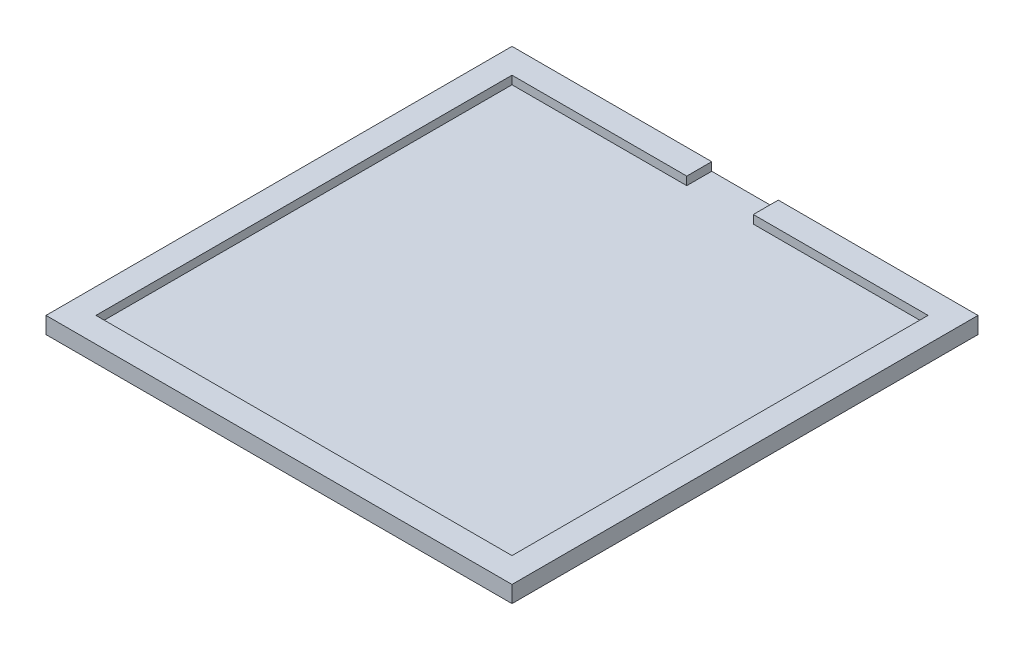
ISO-10303-21;
HEADER;
FILE_DESCRIPTION(('STEP AP214'),'2;1');
FILE_NAME('part.step','',(''),(''),'','','');
FILE_SCHEMA(('AUTOMOTIVE_DESIGN { 1 0 10303 214 1 1 1 1 }'));
ENDSEC;
DATA;
#1=APPLICATION_CONTEXT('core data for automotive mechanical design processes');
#2=APPLICATION_PROTOCOL_DEFINITION('international standard','automotive_design',2000,#1);
#3=PRODUCT_CONTEXT('',#1,'mechanical');
#4=PRODUCT('Part','Part','',(#3));
#5=PRODUCT_RELATED_PRODUCT_CATEGORY('part','',(#4));
#6=PRODUCT_DEFINITION_FORMATION('','',#4);
#7=PRODUCT_DEFINITION_CONTEXT('part definition',#1,'design');
#8=PRODUCT_DEFINITION('design','',#6,#7);
#9=PRODUCT_DEFINITION_SHAPE('','',#8);
#10=(LENGTH_UNIT() NAMED_UNIT(*) SI_UNIT(.MILLI.,.METRE.));
#11=(NAMED_UNIT(*) PLANE_ANGLE_UNIT() SI_UNIT($,.RADIAN.));
#12=(NAMED_UNIT(*) SI_UNIT($,.STERADIAN.) SOLID_ANGLE_UNIT());
#13=UNCERTAINTY_MEASURE_WITH_UNIT(LENGTH_MEASURE(1.E-05),#10,'distance_accuracy_value','');
#14=(GEOMETRIC_REPRESENTATION_CONTEXT(3) GLOBAL_UNCERTAINTY_ASSIGNED_CONTEXT((#13)) GLOBAL_UNIT_ASSIGNED_CONTEXT((#10,
#11,#12)) REPRESENTATION_CONTEXT('',''));
#15=CARTESIAN_POINT('',(0.,0.,0.));
#16=DIRECTION('',(0.,0.,1.));
#17=DIRECTION('',(1.,0.,0.));
#18=AXIS2_PLACEMENT_3D('',#15,#16,#17);
#19=CARTESIAN_POINT('',(0.,2.,-25.));
#20=DIRECTION('',(0.,0.,-1.));
#21=DIRECTION('',(-1.,0.,0.));
#22=AXIS2_PLACEMENT_3D('',#19,#20,#21);
#23=PLANE('',#22);
#24=DIRECTION('',(-1.,0.,0.));
#25=VECTOR('',#24,1.);
#26=CARTESIAN_POINT('',(0.,1.,-25.));
#27=LINE('',#26,#25);
#28=CARTESIAN_POINT('',(-4.,1.,-25.));
#29=VERTEX_POINT('',#28);
#30=CARTESIAN_POINT('',(-25.,1.,-25.));
#31=VERTEX_POINT('',#30);
#32=EDGE_CURVE('E190',#29,#31,#27,.T.);
#33=ORIENTED_EDGE('',*,*,#32,.F.);
#34=DIRECTION('',(0.,1.,0.));
#35=VECTOR('',#34,1.);
#36=CARTESIAN_POINT('',(-4.,2.,-25.));
#37=LINE('',#36,#35);
#38=CARTESIAN_POINT('',(-4.,2.,-25.));
#39=VERTEX_POINT('',#38);
#40=EDGE_CURVE('E138',#29,#39,#37,.T.);
#41=ORIENTED_EDGE('',*,*,#40,.T.);
#42=DIRECTION('',(1.,0.,0.));
#43=VECTOR('',#42,1.);
#44=CARTESIAN_POINT('',(0.,2.,-25.));
#45=LINE('',#44,#43);
#46=CARTESIAN_POINT('',(-25.,2.,-25.));
#47=VERTEX_POINT('',#46);
#48=EDGE_CURVE('E160',#47,#39,#45,.T.);
#49=ORIENTED_EDGE('',*,*,#48,.F.);
#50=DIRECTION('',(0.,-1.,0.));
#51=VECTOR('',#50,1.);
#52=CARTESIAN_POINT('',(-25.,2.,-25.));
#53=LINE('',#52,#51);
#54=EDGE_CURVE('E171',#47,#31,#53,.T.);
#55=ORIENTED_EDGE('',*,*,#54,.T.);
#56=EDGE_LOOP('',(#33,#41,#49,#55));
#57=FACE_BOUND('',#56,.T.);
#58=ADVANCED_FACE('F35',(#57),#23,.F.);
#59=CARTESIAN_POINT('',(0.,1.,-28.));
#60=DIRECTION('',(0.,0.,-1.));
#61=DIRECTION('',(-1.,0.,0.));
#62=AXIS2_PLACEMENT_3D('',#59,#60,#61);
#63=PLANE('',#62);
#64=DIRECTION('',(0.,1.,0.));
#65=VECTOR('',#64,1.);
#66=CARTESIAN_POINT('',(-4.,1.,-28.));
#67=LINE('',#66,#65);
#68=CARTESIAN_POINT('',(-4.,1.,-28.));
#69=VERTEX_POINT('',#68);
#70=CARTESIAN_POINT('',(-4.,2.,-28.));
#71=VERTEX_POINT('',#70);
#72=EDGE_CURVE('E150',#69,#71,#67,.T.);
#73=ORIENTED_EDGE('',*,*,#72,.F.);
#74=DIRECTION('',(-1.,0.,0.));
#75=VECTOR('',#74,1.);
#76=CARTESIAN_POINT('',(0.,1.,-28.));
#77=LINE('',#76,#75);
#78=CARTESIAN_POINT('',(4.,1.,-28.));
#79=VERTEX_POINT('',#78);
#80=EDGE_CURVE('E137',#79,#69,#77,.T.);
#81=ORIENTED_EDGE('',*,*,#80,.F.);
#82=DIRECTION('',(0.,-1.,0.));
#83=VECTOR('',#82,1.);
#84=CARTESIAN_POINT('',(4.,1.,-28.));
#85=LINE('',#84,#83);
#86=CARTESIAN_POINT('',(4.,2.,-28.));
#87=VERTEX_POINT('',#86);
#88=EDGE_CURVE('E124',#87,#79,#85,.T.);
#89=ORIENTED_EDGE('',*,*,#88,.F.);
#90=DIRECTION('',(1.,0.,0.));
#91=VECTOR('',#90,1.);
#92=CARTESIAN_POINT('',(0.,2.,-28.));
#93=LINE('',#92,#91);
#94=CARTESIAN_POINT('',(28.,2.,-28.));
#95=VERTEX_POINT('',#94);
#96=EDGE_CURVE('E135',#87,#95,#93,.T.);
#97=ORIENTED_EDGE('',*,*,#96,.T.);
#98=DIRECTION('',(0.,-1.,0.));
#99=VECTOR('',#98,1.);
#100=CARTESIAN_POINT('',(28.,1.,-28.));
#101=LINE('',#100,#99);
#102=CARTESIAN_POINT('',(28.,0.,-28.));
#103=VERTEX_POINT('',#102);
#104=EDGE_CURVE('E204',#95,#103,#101,.T.);
#105=ORIENTED_EDGE('',*,*,#104,.T.);
#106=DIRECTION('',(1.,0.,0.));
#107=VECTOR('',#106,1.);
#108=CARTESIAN_POINT('',(0.,0.,-28.));
#109=LINE('',#108,#107);
#110=CARTESIAN_POINT('',(-28.,0.,-28.));
#111=VERTEX_POINT('',#110);
#112=EDGE_CURVE('E193',#111,#103,#109,.T.);
#113=ORIENTED_EDGE('',*,*,#112,.F.);
#114=DIRECTION('',(0.,-1.,0.));
#115=VECTOR('',#114,1.);
#116=CARTESIAN_POINT('',(-28.,1.,-28.));
#117=LINE('',#116,#115);
#118=CARTESIAN_POINT('',(-28.,2.,-28.));
#119=VERTEX_POINT('',#118);
#120=EDGE_CURVE('E11',#119,#111,#117,.T.);
#121=ORIENTED_EDGE('',*,*,#120,.F.);
#122=EDGE_CURVE('E146',#119,#71,#93,.T.);
#123=ORIENTED_EDGE('',*,*,#122,.T.);
#124=EDGE_LOOP('',(#73,#81,#89,#97,#105,#113,#121,#123));
#125=FACE_BOUND('',#124,.T.);
#126=ADVANCED_FACE('F37',(#125),#63,.T.);
#127=CARTESIAN_POINT('',(-28.,1.,0.));
#128=DIRECTION('',(1.,0.,0.));
#129=DIRECTION('',(0.,0.,-1.));
#130=AXIS2_PLACEMENT_3D('',#127,#128,#129);
#131=PLANE('',#130);
#132=DIRECTION('',(0.,0.,1.));
#133=VECTOR('',#132,1.);
#134=CARTESIAN_POINT('',(-28.,0.,0.));
#135=LINE('',#134,#133);
#136=CARTESIAN_POINT('',(-28.,0.,28.));
#137=VERTEX_POINT('',#136);
#138=EDGE_CURVE('E196',#111,#137,#135,.T.);
#139=ORIENTED_EDGE('',*,*,#138,.T.);
#140=DIRECTION('',(0.,-1.,0.));
#141=VECTOR('',#140,1.);
#142=CARTESIAN_POINT('',(-28.,1.,28.));
#143=LINE('',#142,#141);
#144=CARTESIAN_POINT('',(-28.,2.,28.));
#145=VERTEX_POINT('',#144);
#146=EDGE_CURVE('E43',#145,#137,#143,.T.);
#147=ORIENTED_EDGE('',*,*,#146,.F.);
#148=DIRECTION('',(0.,0.,1.));
#149=VECTOR('',#148,1.);
#150=CARTESIAN_POINT('',(-28.,2.,0.));
#151=LINE('',#150,#149);
#152=EDGE_CURVE('E149',#119,#145,#151,.T.);
#153=ORIENTED_EDGE('',*,*,#152,.F.);
#154=ORIENTED_EDGE('',*,*,#120,.T.);
#155=EDGE_LOOP('',(#139,#147,#153,#154));
#156=FACE_BOUND('',#155,.T.);
#157=ADVANCED_FACE('F222',(#156),#131,.F.);
#158=CARTESIAN_POINT('',(0.,1.,28.));
#159=DIRECTION('',(0.,0.,-1.));
#160=DIRECTION('',(-1.,0.,0.));
#161=AXIS2_PLACEMENT_3D('',#158,#159,#160);
#162=PLANE('',#161);
#163=DIRECTION('',(1.,0.,0.));
#164=VECTOR('',#163,1.);
#165=CARTESIAN_POINT('',(0.,0.,28.));
#166=LINE('',#165,#164);
#167=CARTESIAN_POINT('',(28.,0.,28.));
#168=VERTEX_POINT('',#167);
#169=EDGE_CURVE('E198',#137,#168,#166,.T.);
#170=ORIENTED_EDGE('',*,*,#169,.T.);
#171=DIRECTION('',(0.,-1.,0.));
#172=VECTOR('',#171,1.);
#173=CARTESIAN_POINT('',(28.,1.,28.));
#174=LINE('',#173,#172);
#175=CARTESIAN_POINT('',(28.,2.,28.));
#176=VERTEX_POINT('',#175);
#177=EDGE_CURVE('E206',#176,#168,#174,.T.);
#178=ORIENTED_EDGE('',*,*,#177,.F.);
#179=DIRECTION('',(1.,0.,0.));
#180=VECTOR('',#179,1.);
#181=CARTESIAN_POINT('',(0.,2.,28.));
#182=LINE('',#181,#180);
#183=EDGE_CURVE('E156',#145,#176,#182,.T.);
#184=ORIENTED_EDGE('',*,*,#183,.F.);
#185=ORIENTED_EDGE('',*,*,#146,.T.);
#186=EDGE_LOOP('',(#170,#178,#184,#185));
#187=FACE_BOUND('',#186,.T.);
#188=ADVANCED_FACE('F211',(#187),#162,.F.);
#189=CARTESIAN_POINT('',(28.,1.,0.));
#190=DIRECTION('',(1.,0.,0.));
#191=DIRECTION('',(0.,0.,-1.));
#192=AXIS2_PLACEMENT_3D('',#189,#190,#191);
#193=PLANE('',#192);
#194=DIRECTION('',(0.,0.,1.));
#195=VECTOR('',#194,1.);
#196=CARTESIAN_POINT('',(28.,0.,0.));
#197=LINE('',#196,#195);
#198=EDGE_CURVE('E201',#103,#168,#197,.T.);
#199=ORIENTED_EDGE('',*,*,#198,.F.);
#200=ORIENTED_EDGE('',*,*,#104,.F.);
#201=DIRECTION('',(0.,0.,1.));
#202=VECTOR('',#201,1.);
#203=CARTESIAN_POINT('',(28.,2.,0.));
#204=LINE('',#203,#202);
#205=EDGE_CURVE('E145',#95,#176,#204,.T.);
#206=ORIENTED_EDGE('',*,*,#205,.T.);
#207=ORIENTED_EDGE('',*,*,#177,.T.);
#208=EDGE_LOOP('',(#199,#200,#206,#207));
#209=FACE_BOUND('',#208,.T.);
#210=ADVANCED_FACE('F220',(#209),#193,.T.);
#211=CARTESIAN_POINT('',(0.,0.,0.));
#212=DIRECTION('',(0.,1.,0.));
#213=DIRECTION('',(0.,0.,1.));
#214=AXIS2_PLACEMENT_3D('',#211,#212,#213);
#215=PLANE('',#214);
#216=ORIENTED_EDGE('',*,*,#112,.T.);
#217=ORIENTED_EDGE('',*,*,#198,.T.);
#218=ORIENTED_EDGE('',*,*,#169,.F.);
#219=ORIENTED_EDGE('',*,*,#138,.F.);
#220=EDGE_LOOP('',(#216,#217,#218,#219));
#221=FACE_BOUND('',#220,.T.);
#222=ADVANCED_FACE('F216',(#221),#215,.F.);
#223=CARTESIAN_POINT('',(4.,2.,-25.));
#224=VERTEX_POINT('',#223);
#225=CARTESIAN_POINT('',(25.,2.,-25.));
#226=VERTEX_POINT('',#225);
#227=EDGE_CURVE('E159',#224,#226,#45,.T.);
#228=ORIENTED_EDGE('',*,*,#227,.F.);
#229=DIRECTION('',(0.,-1.,0.));
#230=VECTOR('',#229,1.);
#231=CARTESIAN_POINT('',(4.,2.,-25.));
#232=LINE('',#231,#230);
#233=CARTESIAN_POINT('',(4.,1.,-25.));
#234=VERTEX_POINT('',#233);
#235=EDGE_CURVE('E50',#224,#234,#232,.T.);
#236=ORIENTED_EDGE('',*,*,#235,.T.);
#237=CARTESIAN_POINT('',(25.,1.,-25.));
#238=VERTEX_POINT('',#237);
#239=EDGE_CURVE('E191',#238,#234,#27,.T.);
#240=ORIENTED_EDGE('',*,*,#239,.F.);
#241=DIRECTION('',(0.,-1.,0.));
#242=VECTOR('',#241,1.);
#243=CARTESIAN_POINT('',(25.,2.,-25.));
#244=LINE('',#243,#242);
#245=EDGE_CURVE('E180',#226,#238,#244,.T.);
#246=ORIENTED_EDGE('',*,*,#245,.F.);
#247=EDGE_LOOP('',(#228,#236,#240,#246));
#248=FACE_BOUND('',#247,.T.);
#249=ADVANCED_FACE('F249',(#248),#23,.F.);
#250=CARTESIAN_POINT('',(25.,2.,0.));
#251=DIRECTION('',(1.,0.,0.));
#252=DIRECTION('',(0.,0.,-1.));
#253=AXIS2_PLACEMENT_3D('',#250,#251,#252);
#254=PLANE('',#253);
#255=DIRECTION('',(0.,0.,-1.));
#256=VECTOR('',#255,1.);
#257=CARTESIAN_POINT('',(25.,1.,0.));
#258=LINE('',#257,#256);
#259=CARTESIAN_POINT('',(25.,1.,25.));
#260=VERTEX_POINT('',#259);
#261=EDGE_CURVE('E58',#260,#238,#258,.T.);
#262=ORIENTED_EDGE('',*,*,#261,.F.);
#263=DIRECTION('',(0.,-1.,0.));
#264=VECTOR('',#263,1.);
#265=CARTESIAN_POINT('',(25.,2.,25.));
#266=LINE('',#265,#264);
#267=CARTESIAN_POINT('',(25.,2.,25.));
#268=VERTEX_POINT('',#267);
#269=EDGE_CURVE('E177',#268,#260,#266,.T.);
#270=ORIENTED_EDGE('',*,*,#269,.F.);
#271=DIRECTION('',(0.,0.,1.));
#272=VECTOR('',#271,1.);
#273=CARTESIAN_POINT('',(25.,2.,0.));
#274=LINE('',#273,#272);
#275=EDGE_CURVE('E163',#226,#268,#274,.T.);
#276=ORIENTED_EDGE('',*,*,#275,.F.);
#277=ORIENTED_EDGE('',*,*,#245,.T.);
#278=EDGE_LOOP('',(#262,#270,#276,#277));
#279=FACE_BOUND('',#278,.T.);
#280=ADVANCED_FACE('F246',(#279),#254,.F.);
#281=CARTESIAN_POINT('',(0.,2.,25.));
#282=DIRECTION('',(0.,0.,-1.));
#283=DIRECTION('',(-1.,0.,0.));
#284=AXIS2_PLACEMENT_3D('',#281,#282,#283);
#285=PLANE('',#284);
#286=ORIENTED_EDGE('',*,*,#269,.T.);
#287=DIRECTION('',(-1.,0.,0.));
#288=VECTOR('',#287,1.);
#289=CARTESIAN_POINT('',(0.,1.,25.));
#290=LINE('',#289,#288);
#291=CARTESIAN_POINT('',(-25.,1.,25.));
#292=VERTEX_POINT('',#291);
#293=EDGE_CURVE('E186',#260,#292,#290,.T.);
#294=ORIENTED_EDGE('',*,*,#293,.T.);
#295=DIRECTION('',(0.,-1.,0.));
#296=VECTOR('',#295,1.);
#297=CARTESIAN_POINT('',(-25.,2.,25.));
#298=LINE('',#297,#296);
#299=CARTESIAN_POINT('',(-25.,2.,25.));
#300=VERTEX_POINT('',#299);
#301=EDGE_CURVE('E174',#300,#292,#298,.T.);
#302=ORIENTED_EDGE('',*,*,#301,.F.);
#303=DIRECTION('',(1.,0.,0.));
#304=VECTOR('',#303,1.);
#305=CARTESIAN_POINT('',(0.,2.,25.));
#306=LINE('',#305,#304);
#307=EDGE_CURVE('E165',#300,#268,#306,.T.);
#308=ORIENTED_EDGE('',*,*,#307,.T.);
#309=EDGE_LOOP('',(#286,#294,#302,#308));
#310=FACE_BOUND('',#309,.T.);
#311=ADVANCED_FACE('F241',(#310),#285,.T.);
#312=CARTESIAN_POINT('',(-25.,2.,0.));
#313=DIRECTION('',(1.,0.,0.));
#314=DIRECTION('',(0.,0.,-1.));
#315=AXIS2_PLACEMENT_3D('',#312,#313,#314);
#316=PLANE('',#315);
#317=ORIENTED_EDGE('',*,*,#301,.T.);
#318=DIRECTION('',(0.,0.,-1.));
#319=VECTOR('',#318,1.);
#320=CARTESIAN_POINT('',(-25.,1.,0.));
#321=LINE('',#320,#319);
#322=EDGE_CURVE('E183',#292,#31,#321,.T.);
#323=ORIENTED_EDGE('',*,*,#322,.T.);
#324=ORIENTED_EDGE('',*,*,#54,.F.);
#325=DIRECTION('',(0.,0.,1.));
#326=VECTOR('',#325,1.);
#327=CARTESIAN_POINT('',(-25.,2.,0.));
#328=LINE('',#327,#326);
#329=EDGE_CURVE('E168',#47,#300,#328,.T.);
#330=ORIENTED_EDGE('',*,*,#329,.T.);
#331=EDGE_LOOP('',(#317,#323,#324,#330));
#332=FACE_BOUND('',#331,.T.);
#333=ADVANCED_FACE('F239',(#332),#316,.T.);
#334=CARTESIAN_POINT('',(0.,2.,0.));
#335=DIRECTION('',(0.,1.,0.));
#336=DIRECTION('',(0.,0.,1.));
#337=AXIS2_PLACEMENT_3D('',#334,#335,#336);
#338=PLANE('',#337);
#339=DIRECTION('',(0.,0.,1.));
#340=VECTOR('',#339,1.);
#341=CARTESIAN_POINT('',(-4.,2.,-41.6755189015134));
#342=LINE('',#341,#340);
#343=EDGE_CURVE('E130',#71,#39,#342,.T.);
#344=ORIENTED_EDGE('',*,*,#343,.F.);
#345=ORIENTED_EDGE('',*,*,#122,.F.);
#346=ORIENTED_EDGE('',*,*,#152,.T.);
#347=ORIENTED_EDGE('',*,*,#183,.T.);
#348=ORIENTED_EDGE('',*,*,#205,.F.);
#349=ORIENTED_EDGE('',*,*,#96,.F.);
#350=DIRECTION('',(0.,0.,-1.));
#351=VECTOR('',#350,1.);
#352=CARTESIAN_POINT('',(4.,2.,-41.6755189015134));
#353=LINE('',#352,#351);
#354=EDGE_CURVE('E121',#224,#87,#353,.T.);
#355=ORIENTED_EDGE('',*,*,#354,.F.);
#356=ORIENTED_EDGE('',*,*,#227,.T.);
#357=ORIENTED_EDGE('',*,*,#275,.T.);
#358=ORIENTED_EDGE('',*,*,#307,.F.);
#359=ORIENTED_EDGE('',*,*,#329,.F.);
#360=ORIENTED_EDGE('',*,*,#48,.T.);
#361=EDGE_LOOP('',(#344,#345,#346,#347,#348,#349,#355,#356,#357,#358,#359,#360));
#362=FACE_BOUND('',#361,.T.);
#363=ADVANCED_FACE('F142',(#362),#338,.T.);
#364=CARTESIAN_POINT('',(0.,1.,0.));
#365=DIRECTION('',(0.,1.,0.));
#366=DIRECTION('',(0.,0.,1.));
#367=AXIS2_PLACEMENT_3D('',#364,#365,#366);
#368=PLANE('',#367);
#369=ORIENTED_EDGE('',*,*,#239,.T.);
#370=DIRECTION('',(0.,0.,-1.));
#371=VECTOR('',#370,1.);
#372=CARTESIAN_POINT('',(4.,1.,-41.6755189015134));
#373=LINE('',#372,#371);
#374=EDGE_CURVE('E228',#234,#79,#373,.T.);
#375=ORIENTED_EDGE('',*,*,#374,.T.);
#376=ORIENTED_EDGE('',*,*,#80,.T.);
#377=DIRECTION('',(0.,0.,1.));
#378=VECTOR('',#377,1.);
#379=CARTESIAN_POINT('',(-4.,1.,-41.6755189015134));
#380=LINE('',#379,#378);
#381=EDGE_CURVE('E129',#69,#29,#380,.T.);
#382=ORIENTED_EDGE('',*,*,#381,.T.);
#383=ORIENTED_EDGE('',*,*,#32,.T.);
#384=ORIENTED_EDGE('',*,*,#322,.F.);
#385=ORIENTED_EDGE('',*,*,#293,.F.);
#386=ORIENTED_EDGE('',*,*,#261,.T.);
#387=EDGE_LOOP('',(#369,#375,#376,#382,#383,#384,#385,#386));
#388=FACE_BOUND('',#387,.T.);
#389=ADVANCED_FACE('F234',(#388),#368,.T.);
#390=CARTESIAN_POINT('',(-4.,1.,-41.6755189015134));
#391=DIRECTION('',(-1.,0.,0.));
#392=DIRECTION('',(0.,0.,1.));
#393=AXIS2_PLACEMENT_3D('',#390,#391,#392);
#394=PLANE('',#393);
#395=ORIENTED_EDGE('',*,*,#72,.T.);
#396=ORIENTED_EDGE('',*,*,#343,.T.);
#397=ORIENTED_EDGE('',*,*,#40,.F.);
#398=ORIENTED_EDGE('',*,*,#381,.F.);
#399=EDGE_LOOP('',(#395,#396,#397,#398));
#400=FACE_BOUND('',#399,.T.);
#401=ADVANCED_FACE('F250',(#400),#394,.F.);
#402=CARTESIAN_POINT('',(4.,1.,-41.6755189015134));
#403=DIRECTION('',(1.,0.,0.));
#404=DIRECTION('',(0.,0.,-1.));
#405=AXIS2_PLACEMENT_3D('',#402,#403,#404);
#406=PLANE('',#405);
#407=ORIENTED_EDGE('',*,*,#88,.T.);
#408=ORIENTED_EDGE('',*,*,#374,.F.);
#409=ORIENTED_EDGE('',*,*,#235,.F.);
#410=ORIENTED_EDGE('',*,*,#354,.T.);
#411=EDGE_LOOP('',(#407,#408,#409,#410));
#412=FACE_BOUND('',#411,.T.);
#413=ADVANCED_FACE('F123',(#412),#406,.F.);
#414=CLOSED_SHELL('',(#58,#126,#157,#188,#210,#222,#249,#280,#311,#333,#363,#389,#401,#413));
#415=MANIFOLD_SOLID_BREP('B2',#414);
#416=ADVANCED_BREP_SHAPE_REPRESENTATION('',(#18,#415),#14);
#417=SHAPE_DEFINITION_REPRESENTATION(#9,#416);
ENDSEC;
END-ISO-10303-21;
